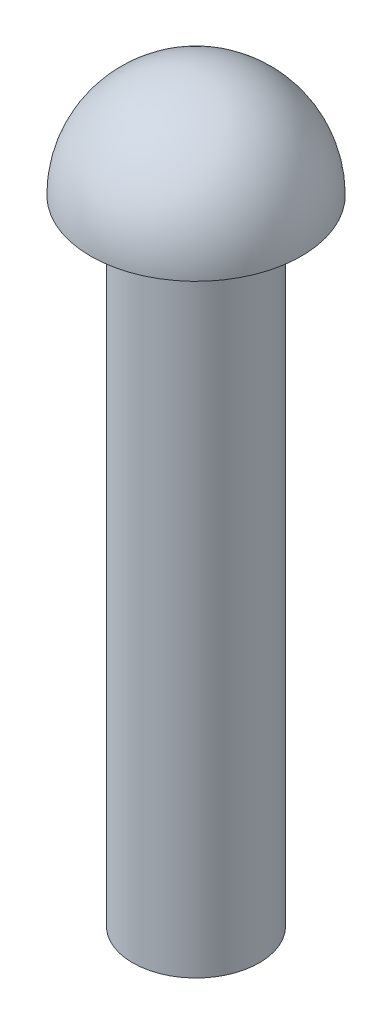
ISO-10303-21;
HEADER;
FILE_DESCRIPTION(('STEP AP214'),'2;1');
FILE_NAME('part.step','',(''),(''),'','','');
FILE_SCHEMA(('AUTOMOTIVE_DESIGN { 1 0 10303 214 1 1 1 1 }'));
ENDSEC;
DATA;
#1=APPLICATION_CONTEXT('core data for automotive mechanical design processes');
#2=APPLICATION_PROTOCOL_DEFINITION('international standard','automotive_design',2000,#1);
#3=PRODUCT_CONTEXT('',#1,'mechanical');
#4=PRODUCT('Part','Part','',(#3));
#5=PRODUCT_RELATED_PRODUCT_CATEGORY('part','',(#4));
#6=PRODUCT_DEFINITION_FORMATION('','',#4);
#7=PRODUCT_DEFINITION_CONTEXT('part definition',#1,'design');
#8=PRODUCT_DEFINITION('design','',#6,#7);
#9=PRODUCT_DEFINITION_SHAPE('','',#8);
#10=(LENGTH_UNIT() NAMED_UNIT(*) SI_UNIT(.MILLI.,.METRE.));
#11=(NAMED_UNIT(*) PLANE_ANGLE_UNIT() SI_UNIT($,.RADIAN.));
#12=(NAMED_UNIT(*) SI_UNIT($,.STERADIAN.) SOLID_ANGLE_UNIT());
#13=UNCERTAINTY_MEASURE_WITH_UNIT(LENGTH_MEASURE(1.E-05),#10,'distance_accuracy_value','');
#14=(GEOMETRIC_REPRESENTATION_CONTEXT(3) GLOBAL_UNCERTAINTY_ASSIGNED_CONTEXT((#13)) GLOBAL_UNIT_ASSIGNED_CONTEXT((#10,
#11,#12)) REPRESENTATION_CONTEXT('',''));
#15=CARTESIAN_POINT('',(0.,0.,0.));
#16=DIRECTION('',(0.,0.,1.));
#17=DIRECTION('',(1.,0.,0.));
#18=AXIS2_PLACEMENT_3D('',#15,#16,#17);
#19=CARTESIAN_POINT('',(0.,38.1,0.));
#20=DIRECTION('',(0.,-1.,0.));
#21=DIRECTION('',(0.,0.,-1.));
#22=AXIS2_PLACEMENT_3D('',#19,#20,#21);
#23=CYLINDRICAL_SURFACE('',#22,3.81);
#24=CARTESIAN_POINT('',(0.,38.1,0.));
#25=DIRECTION('',(0.,1.,0.));
#26=DIRECTION('',(0.,0.,1.));
#27=AXIS2_PLACEMENT_3D('',#24,#25,#26);
#28=CIRCLE('',#27,3.81);
#29=CARTESIAN_POINT('',(0.,38.1,3.81));
#30=VERTEX_POINT('',#29);
#31=EDGE_CURVE('E10',#30,#30,#28,.T.);
#32=ORIENTED_EDGE('',*,*,#31,.F.);
#33=EDGE_LOOP('',(#32));
#34=FACE_BOUND('',#33,.T.);
#35=CARTESIAN_POINT('',(0.,0.,0.));
#36=DIRECTION('',(0.,1.,0.));
#37=DIRECTION('',(0.,0.,1.));
#38=AXIS2_PLACEMENT_3D('',#35,#36,#37);
#39=CIRCLE('',#38,3.81);
#40=CARTESIAN_POINT('',(0.,0.,3.81));
#41=VERTEX_POINT('',#40);
#42=EDGE_CURVE('E34',#41,#41,#39,.T.);
#43=ORIENTED_EDGE('',*,*,#42,.T.);
#44=EDGE_LOOP('',(#43));
#45=FACE_BOUND('',#44,.T.);
#46=ADVANCED_FACE('F31',(#34,#45),#23,.T.);
#47=CARTESIAN_POINT('',(0.,0.,0.));
#48=DIRECTION('',(0.,1.,0.));
#49=DIRECTION('',(0.,0.,1.));
#50=AXIS2_PLACEMENT_3D('',#47,#48,#49);
#51=PLANE('',#50);
#52=ORIENTED_EDGE('',*,*,#42,.F.);
#53=EDGE_LOOP('',(#52));
#54=FACE_BOUND('',#53,.T.);
#55=ADVANCED_FACE('F50',(#54),#51,.F.);
#56=CARTESIAN_POINT('',(0.,38.1,0.));
#57=DIRECTION('',(0.,1.,0.));
#58=DIRECTION('',(0.,0.,1.));
#59=AXIS2_PLACEMENT_3D('',#56,#57,#58);
#60=PLANE('',#59);
#61=ORIENTED_EDGE('',*,*,#31,.T.);
#62=EDGE_LOOP('',(#61));
#63=FACE_BOUND('',#62,.T.);
#64=CARTESIAN_POINT('',(0.,38.1,0.));
#65=DIRECTION('',(0.,1.,0.));
#66=DIRECTION('',(0.,0.,1.));
#67=AXIS2_PLACEMENT_3D('',#64,#65,#66);
#68=CIRCLE('',#67,6.35);
#69=CARTESIAN_POINT('',(0.,38.1,6.35));
#70=VERTEX_POINT('',#69);
#71=EDGE_CURVE('E41',#70,#70,#68,.T.);
#72=ORIENTED_EDGE('',*,*,#71,.F.);
#73=EDGE_LOOP('',(#72));
#74=FACE_BOUND('',#73,.T.);
#75=ADVANCED_FACE('F48',(#63,#74),#60,.F.);
#76=CARTESIAN_POINT('',(0.,38.1,0.));
#77=DIRECTION('',(0.,1.,0.));
#78=DIRECTION('',(0.,0.,-1.));
#79=AXIS2_PLACEMENT_3D('',#76,#77,#78);
#80=SPHERICAL_SURFACE('',#79,6.35);
#81=ORIENTED_EDGE('',*,*,#71,.T.);
#82=EDGE_LOOP('',(#81));
#83=FACE_BOUND('',#82,.T.);
#84=ADVANCED_FACE('F46',(#83),#80,.T.);
#85=CLOSED_SHELL('',(#46,#55,#75,#84));
#86=MANIFOLD_SOLID_BREP('B2',#85);
#87=ADVANCED_BREP_SHAPE_REPRESENTATION('',(#18,#86),#14);
#88=SHAPE_DEFINITION_REPRESENTATION(#9,#87);
ENDSEC;
END-ISO-10303-21;
